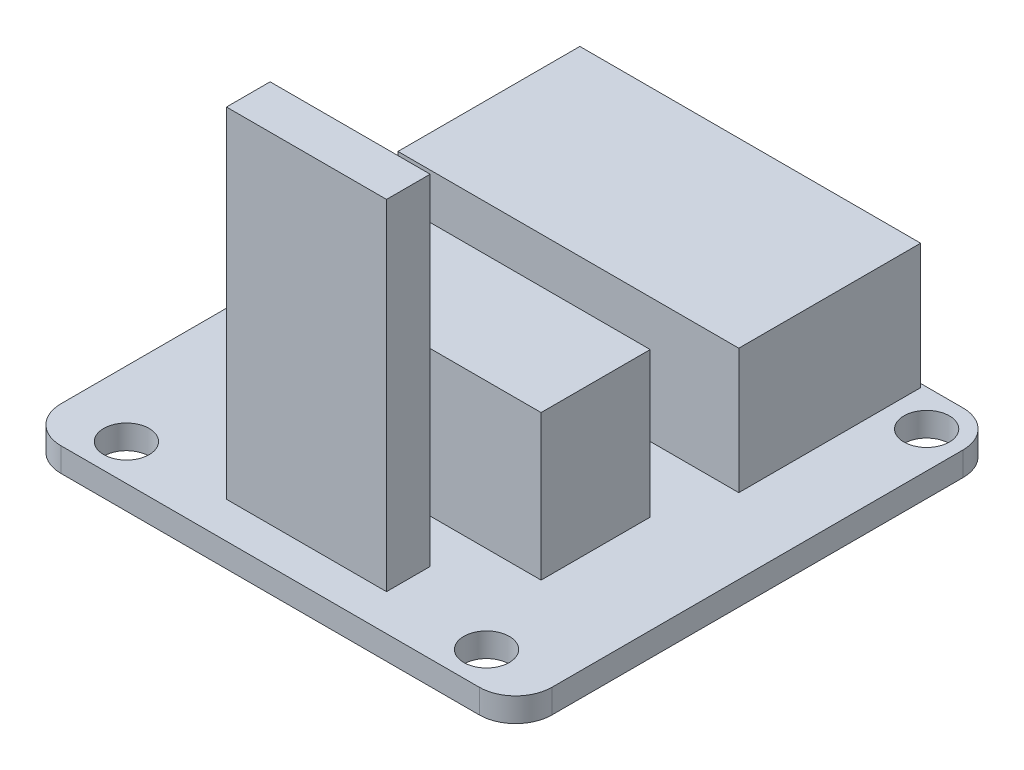
ISO-10303-21;
HEADER;
FILE_DESCRIPTION(('STEP AP214'),'2;1');
FILE_NAME('part.step','',(''),(''),'','','');
FILE_SCHEMA(('AUTOMOTIVE_DESIGN { 1 0 10303 214 1 1 1 1 }'));
ENDSEC;
DATA;
#1=APPLICATION_CONTEXT('core data for automotive mechanical design processes');
#2=APPLICATION_PROTOCOL_DEFINITION('international standard','automotive_design',2000,#1);
#3=PRODUCT_CONTEXT('',#1,'mechanical');
#4=PRODUCT('Part','Part','',(#3));
#5=PRODUCT_RELATED_PRODUCT_CATEGORY('part','',(#4));
#6=PRODUCT_DEFINITION_FORMATION('','',#4);
#7=PRODUCT_DEFINITION_CONTEXT('part definition',#1,'design');
#8=PRODUCT_DEFINITION('design','',#6,#7);
#9=PRODUCT_DEFINITION_SHAPE('','',#8);
#10=(LENGTH_UNIT() NAMED_UNIT(*) SI_UNIT(.MILLI.,.METRE.));
#11=(NAMED_UNIT(*) PLANE_ANGLE_UNIT() SI_UNIT($,.RADIAN.));
#12=(NAMED_UNIT(*) SI_UNIT($,.STERADIAN.) SOLID_ANGLE_UNIT());
#13=UNCERTAINTY_MEASURE_WITH_UNIT(LENGTH_MEASURE(1.E-05),#10,'distance_accuracy_value','');
#14=(GEOMETRIC_REPRESENTATION_CONTEXT(3) GLOBAL_UNCERTAINTY_ASSIGNED_CONTEXT((#13)) GLOBAL_UNIT_ASSIGNED_CONTEXT((#10,
#11,#12)) REPRESENTATION_CONTEXT('',''));
#15=CARTESIAN_POINT('',(0.,0.,0.));
#16=DIRECTION('',(0.,0.,1.));
#17=DIRECTION('',(1.,0.,0.));
#18=AXIS2_PLACEMENT_3D('',#15,#16,#17);
#19=CARTESIAN_POINT('',(0.,1.6764,0.));
#20=DIRECTION('',(0.,1.,0.));
#21=DIRECTION('',(0.,0.,1.));
#22=AXIS2_PLACEMENT_3D('',#19,#20,#21);
#23=PLANE('',#22);
#24=DIRECTION('',(0.,0.,1.));
#25=VECTOR('',#24,1.);
#26=CARTESIAN_POINT('',(-5.588,1.6764,0.));
#27=LINE('',#26,#25);
#28=CARTESIAN_POINT('',(-5.588,1.6764,11.303));
#29=VERTEX_POINT('',#28);
#30=CARTESIAN_POINT('',(-5.588,1.6764,14.351));
#31=VERTEX_POINT('',#30);
#32=EDGE_CURVE('E203',#29,#31,#27,.T.);
#33=ORIENTED_EDGE('',*,*,#32,.F.);
#34=DIRECTION('',(-1.,0.,0.));
#35=VECTOR('',#34,1.);
#36=CARTESIAN_POINT('',(0.,1.6764,11.303));
#37=LINE('',#36,#35);
#38=CARTESIAN_POINT('',(5.588,1.6764,11.303));
#39=VERTEX_POINT('',#38);
#40=EDGE_CURVE('E173',#39,#29,#37,.T.);
#41=ORIENTED_EDGE('',*,*,#40,.F.);
#42=DIRECTION('',(0.,0.,1.));
#43=VECTOR('',#42,1.);
#44=CARTESIAN_POINT('',(5.588,1.6764,0.));
#45=LINE('',#44,#43);
#46=CARTESIAN_POINT('',(5.588,1.6764,14.351));
#47=VERTEX_POINT('',#46);
#48=EDGE_CURVE('E53',#39,#47,#45,.T.);
#49=ORIENTED_EDGE('',*,*,#48,.T.);
#50=DIRECTION('',(-1.,0.,0.));
#51=VECTOR('',#50,1.);
#52=CARTESIAN_POINT('',(0.,1.6764,14.351));
#53=LINE('',#52,#51);
#54=EDGE_CURVE('E48',#47,#31,#53,.T.);
#55=ORIENTED_EDGE('',*,*,#54,.T.);
#56=EDGE_LOOP('',(#33,#41,#49,#55));
#57=FACE_BOUND('',#56,.T.);
#58=DIRECTION('',(-1.,0.,0.));
#59=VECTOR('',#58,1.);
#60=CARTESIAN_POINT('',(0.,1.6764,-16.637));
#61=LINE('',#60,#59);
#62=CARTESIAN_POINT('',(11.8999,1.6764,-16.637));
#63=VERTEX_POINT('',#62);
#64=CARTESIAN_POINT('',(-11.8999,1.6764,-16.637));
#65=VERTEX_POINT('',#64);
#66=EDGE_CURVE('E267',#63,#65,#61,.T.);
#67=ORIENTED_EDGE('',*,*,#66,.F.);
#68=DIRECTION('',(0.,0.,-1.));
#69=VECTOR('',#68,1.);
#70=CARTESIAN_POINT('',(11.8999,1.6764,0.));
#71=LINE('',#70,#69);
#72=CARTESIAN_POINT('',(11.8999,1.6764,-3.937));
#73=VERTEX_POINT('',#72);
#74=EDGE_CURVE('E252',#73,#63,#71,.T.);
#75=ORIENTED_EDGE('',*,*,#74,.F.);
#76=DIRECTION('',(-1.,0.,0.));
#77=VECTOR('',#76,1.);
#78=CARTESIAN_POINT('',(0.,1.6764,-3.937));
#79=LINE('',#78,#77);
#80=CARTESIAN_POINT('',(-11.8999,1.6764,-3.937));
#81=VERTEX_POINT('',#80);
#82=EDGE_CURVE('E263',#73,#81,#79,.T.);
#83=ORIENTED_EDGE('',*,*,#82,.T.);
#84=DIRECTION('',(0.,0.,-1.));
#85=VECTOR('',#84,1.);
#86=CARTESIAN_POINT('',(-11.8999,1.6764,0.));
#87=LINE('',#86,#85);
#88=EDGE_CURVE('E265',#81,#65,#87,.T.);
#89=ORIENTED_EDGE('',*,*,#88,.T.);
#90=EDGE_LOOP('',(#67,#75,#83,#89));
#91=FACE_BOUND('',#90,.T.);
#92=CARTESIAN_POINT('',(-14.605,1.6764,-14.351));
#93=DIRECTION('',(0.,1.,0.));
#94=DIRECTION('',(0.,0.,1.));
#95=AXIS2_PLACEMENT_3D('',#92,#93,#94);
#96=CIRCLE('',#95,2.54);
#97=CARTESIAN_POINT('',(-17.145,1.6764,-14.351));
#98=VERTEX_POINT('',#97);
#99=CARTESIAN_POINT('',(-14.605,1.6764,-16.891));
#100=VERTEX_POINT('',#99);
#101=EDGE_CURVE('E271',#98,#100,#96,.F.);
#102=ORIENTED_EDGE('',*,*,#101,.F.);
#103=DIRECTION('',(0.,0.,-1.));
#104=VECTOR('',#103,1.);
#105=CARTESIAN_POINT('',(-17.145,1.6764,0.));
#106=LINE('',#105,#104);
#107=CARTESIAN_POINT('',(-17.145,1.6764,14.351));
#108=VERTEX_POINT('',#107);
#109=EDGE_CURVE('E274',#108,#98,#106,.T.);
#110=ORIENTED_EDGE('',*,*,#109,.F.);
#111=CARTESIAN_POINT('',(-14.605,1.6764,14.351));
#112=DIRECTION('',(0.,1.,0.));
#113=DIRECTION('',(0.,0.,1.));
#114=AXIS2_PLACEMENT_3D('',#111,#112,#113);
#115=CIRCLE('',#114,2.54);
#116=CARTESIAN_POINT('',(-14.605,1.6764,16.891));
#117=VERTEX_POINT('',#116);
#118=EDGE_CURVE('E278',#117,#108,#115,.F.);
#119=ORIENTED_EDGE('',*,*,#118,.F.);
#120=DIRECTION('',(1.,0.,0.));
#121=VECTOR('',#120,1.);
#122=CARTESIAN_POINT('',(0.,1.6764,16.891));
#123=LINE('',#122,#121);
#124=CARTESIAN_POINT('',(14.605,1.6764,16.891));
#125=VERTEX_POINT('',#124);
#126=EDGE_CURVE('E281',#117,#125,#123,.T.);
#127=ORIENTED_EDGE('',*,*,#126,.T.);
#128=CARTESIAN_POINT('',(14.605,1.6764,14.351));
#129=DIRECTION('',(0.,1.,0.));
#130=DIRECTION('',(0.,0.,1.));
#131=AXIS2_PLACEMENT_3D('',#128,#129,#130);
#132=CIRCLE('',#131,2.54);
#133=CARTESIAN_POINT('',(17.145,1.6764,14.351));
#134=VERTEX_POINT('',#133);
#135=EDGE_CURVE('E283',#125,#134,#132,.T.);
#136=ORIENTED_EDGE('',*,*,#135,.T.);
#137=DIRECTION('',(0.,0.,-1.));
#138=VECTOR('',#137,1.);
#139=CARTESIAN_POINT('',(17.145,1.6764,0.));
#140=LINE('',#139,#138);
#141=CARTESIAN_POINT('',(17.145,1.6764,-14.351));
#142=VERTEX_POINT('',#141);
#143=EDGE_CURVE('E285',#134,#142,#140,.T.);
#144=ORIENTED_EDGE('',*,*,#143,.T.);
#145=CARTESIAN_POINT('',(14.605,1.6764,-14.351));
#146=DIRECTION('',(0.,1.,0.));
#147=DIRECTION('',(0.,0.,1.));
#148=AXIS2_PLACEMENT_3D('',#145,#146,#147);
#149=CIRCLE('',#148,2.54);
#150=CARTESIAN_POINT('',(14.605,1.6764,-16.891));
#151=VERTEX_POINT('',#150);
#152=EDGE_CURVE('E287',#151,#142,#149,.F.);
#153=ORIENTED_EDGE('',*,*,#152,.F.);
#154=DIRECTION('',(1.,0.,0.));
#155=VECTOR('',#154,1.);
#156=CARTESIAN_POINT('',(0.,1.6764,-16.891));
#157=LINE('',#156,#155);
#158=EDGE_CURVE('E290',#100,#151,#157,.T.);
#159=ORIENTED_EDGE('',*,*,#158,.F.);
#160=EDGE_LOOP('',(#102,#110,#119,#127,#136,#144,#153,#159));
#161=FACE_BOUND('',#160,.T.);
#162=CARTESIAN_POINT('',(14.605,1.6764,-14.351));
#163=DIRECTION('',(0.,1.,0.));
#164=DIRECTION('',(0.,0.,1.));
#165=AXIS2_PLACEMENT_3D('',#162,#163,#164);
#166=CIRCLE('',#165,1.5875);
#167=CARTESIAN_POINT('',(14.605,1.6764,-12.7635));
#168=VERTEX_POINT('',#167);
#169=EDGE_CURVE('E293',#168,#168,#166,.T.);
#170=ORIENTED_EDGE('',*,*,#169,.F.);
#171=EDGE_LOOP('',(#170));
#172=FACE_BOUND('',#171,.T.);
#173=CARTESIAN_POINT('',(12.573,1.6764,14.351));
#174=DIRECTION('',(0.,1.,0.));
#175=DIRECTION('',(0.,0.,1.));
#176=AXIS2_PLACEMENT_3D('',#173,#174,#175);
#177=CIRCLE('',#176,1.5875);
#178=CARTESIAN_POINT('',(12.573,1.6764,15.9385));
#179=VERTEX_POINT('',#178);
#180=EDGE_CURVE('E296',#179,#179,#177,.T.);
#181=ORIENTED_EDGE('',*,*,#180,.F.);
#182=EDGE_LOOP('',(#181));
#183=FACE_BOUND('',#182,.T.);
#184=CARTESIAN_POINT('',(-12.573,1.6764,14.351));
#185=DIRECTION('',(0.,1.,0.));
#186=DIRECTION('',(0.,0.,1.));
#187=AXIS2_PLACEMENT_3D('',#184,#185,#186);
#188=CIRCLE('',#187,1.5875);
#189=CARTESIAN_POINT('',(-12.573,1.6764,15.9385));
#190=VERTEX_POINT('',#189);
#191=EDGE_CURVE('E299',#190,#190,#188,.T.);
#192=ORIENTED_EDGE('',*,*,#191,.F.);
#193=EDGE_LOOP('',(#192));
#194=FACE_BOUND('',#193,.T.);
#195=CARTESIAN_POINT('',(-14.605,1.6764,-14.351));
#196=DIRECTION('',(0.,1.,0.));
#197=DIRECTION('',(0.,0.,1.));
#198=AXIS2_PLACEMENT_3D('',#195,#196,#197);
#199=CIRCLE('',#198,1.5875);
#200=CARTESIAN_POINT('',(-14.605,1.6764,-12.7635));
#201=VERTEX_POINT('',#200);
#202=EDGE_CURVE('E302',#201,#201,#199,.T.);
#203=ORIENTED_EDGE('',*,*,#202,.F.);
#204=EDGE_LOOP('',(#203));
#205=FACE_BOUND('',#204,.T.);
#206=DIRECTION('',(0.,0.,1.));
#207=VECTOR('',#206,1.);
#208=CARTESIAN_POINT('',(10.287,1.6764,0.));
#209=LINE('',#208,#207);
#210=CARTESIAN_POINT('',(10.287,1.6764,0.634999999999998));
#211=VERTEX_POINT('',#210);
#212=CARTESIAN_POINT('',(10.287,1.6764,8.255));
#213=VERTEX_POINT('',#212);
#214=EDGE_CURVE('E234',#211,#213,#209,.T.);
#215=ORIENTED_EDGE('',*,*,#214,.T.);
#216=DIRECTION('',(-1.,0.,0.));
#217=VECTOR('',#216,1.);
#218=CARTESIAN_POINT('',(0.,1.6764,8.255));
#219=LINE('',#218,#217);
#220=CARTESIAN_POINT('',(-10.287,1.6764,8.255));
#221=VERTEX_POINT('',#220);
#222=EDGE_CURVE('E236',#213,#221,#219,.T.);
#223=ORIENTED_EDGE('',*,*,#222,.T.);
#224=DIRECTION('',(0.,0.,1.));
#225=VECTOR('',#224,1.);
#226=CARTESIAN_POINT('',(-10.287,1.6764,0.));
#227=LINE('',#226,#225);
#228=CARTESIAN_POINT('',(-10.287,1.6764,0.634999999999998));
#229=VERTEX_POINT('',#228);
#230=EDGE_CURVE('E228',#229,#221,#227,.T.);
#231=ORIENTED_EDGE('',*,*,#230,.F.);
#232=DIRECTION('',(-1.,0.,0.));
#233=VECTOR('',#232,1.);
#234=CARTESIAN_POINT('',(0.,1.6764,0.634999999999998));
#235=LINE('',#234,#233);
#236=EDGE_CURVE('E231',#211,#229,#235,.T.);
#237=ORIENTED_EDGE('',*,*,#236,.F.);
#238=EDGE_LOOP('',(#215,#223,#231,#237));
#239=FACE_BOUND('',#238,.T.);
#240=ADVANCED_FACE('F33',(#57,#91,#161,#172,#183,#194,#205,#239),#23,.T.);
#241=CARTESIAN_POINT('',(-14.605,1.6764,-14.351));
#242=DIRECTION('',(0.,-1.,0.));
#243=DIRECTION('',(0.,0.,-1.));
#244=AXIS2_PLACEMENT_3D('',#241,#242,#243);
#245=CYLINDRICAL_SURFACE('',#244,2.54);
#246=CARTESIAN_POINT('',(-14.605,0.,-14.351));
#247=DIRECTION('',(0.,1.,0.));
#248=DIRECTION('',(0.,0.,1.));
#249=AXIS2_PLACEMENT_3D('',#246,#247,#248);
#250=CIRCLE('',#249,2.54);
#251=CARTESIAN_POINT('',(-17.145,0.,-14.351));
#252=VERTEX_POINT('',#251);
#253=CARTESIAN_POINT('',(-14.605,0.,-16.891));
#254=VERTEX_POINT('',#253);
#255=EDGE_CURVE('E270',#252,#254,#250,.F.);
#256=ORIENTED_EDGE('',*,*,#255,.F.);
#257=DIRECTION('',(0.,-1.,0.));
#258=VECTOR('',#257,1.);
#259=CARTESIAN_POINT('',(-17.145,1.6764,-14.351));
#260=LINE('',#259,#258);
#261=EDGE_CURVE('E11',#98,#252,#260,.T.);
#262=ORIENTED_EDGE('',*,*,#261,.F.);
#263=ORIENTED_EDGE('',*,*,#101,.T.);
#264=DIRECTION('',(0.,-1.,0.));
#265=VECTOR('',#264,1.);
#266=CARTESIAN_POINT('',(-14.605,1.6764,-16.891));
#267=LINE('',#266,#265);
#268=EDGE_CURVE('E305',#100,#254,#267,.T.);
#269=ORIENTED_EDGE('',*,*,#268,.T.);
#270=EDGE_LOOP('',(#256,#262,#263,#269));
#271=FACE_BOUND('',#270,.T.);
#272=ADVANCED_FACE('F35',(#271),#245,.T.);
#273=CARTESIAN_POINT('',(-17.145,1.6764,0.));
#274=DIRECTION('',(-1.,0.,0.));
#275=DIRECTION('',(0.,0.,1.));
#276=AXIS2_PLACEMENT_3D('',#273,#274,#275);
#277=PLANE('',#276);
#278=DIRECTION('',(0.,0.,-1.));
#279=VECTOR('',#278,1.);
#280=CARTESIAN_POINT('',(-17.145,0.,0.));
#281=LINE('',#280,#279);
#282=CARTESIAN_POINT('',(-17.145,0.,14.351));
#283=VERTEX_POINT('',#282);
#284=EDGE_CURVE('E308',#283,#252,#281,.T.);
#285=ORIENTED_EDGE('',*,*,#284,.F.);
#286=DIRECTION('',(0.,-1.,0.));
#287=VECTOR('',#286,1.);
#288=CARTESIAN_POINT('',(-17.145,1.6764,14.351));
#289=LINE('',#288,#287);
#290=EDGE_CURVE('E41',#108,#283,#289,.T.);
#291=ORIENTED_EDGE('',*,*,#290,.F.);
#292=ORIENTED_EDGE('',*,*,#109,.T.);
#293=ORIENTED_EDGE('',*,*,#261,.T.);
#294=EDGE_LOOP('',(#285,#291,#292,#293));
#295=FACE_BOUND('',#294,.T.);
#296=ADVANCED_FACE('F357',(#295),#277,.T.);
#297=CARTESIAN_POINT('',(-14.605,1.6764,14.351));
#298=DIRECTION('',(0.,-1.,0.));
#299=DIRECTION('',(0.,0.,-1.));
#300=AXIS2_PLACEMENT_3D('',#297,#298,#299);
#301=CYLINDRICAL_SURFACE('',#300,2.54);
#302=CARTESIAN_POINT('',(-14.605,0.,14.351));
#303=DIRECTION('',(0.,1.,0.));
#304=DIRECTION('',(0.,0.,1.));
#305=AXIS2_PLACEMENT_3D('',#302,#303,#304);
#306=CIRCLE('',#305,2.54);
#307=CARTESIAN_POINT('',(-14.605,0.,16.891));
#308=VERTEX_POINT('',#307);
#309=EDGE_CURVE('E311',#308,#283,#306,.F.);
#310=ORIENTED_EDGE('',*,*,#309,.F.);
#311=DIRECTION('',(0.,-1.,0.));
#312=VECTOR('',#311,1.);
#313=CARTESIAN_POINT('',(-14.605,1.6764,16.891));
#314=LINE('',#313,#312);
#315=EDGE_CURVE('E349',#117,#308,#314,.T.);
#316=ORIENTED_EDGE('',*,*,#315,.F.);
#317=ORIENTED_EDGE('',*,*,#118,.T.);
#318=ORIENTED_EDGE('',*,*,#290,.T.);
#319=EDGE_LOOP('',(#310,#316,#317,#318));
#320=FACE_BOUND('',#319,.T.);
#321=ADVANCED_FACE('F353',(#320),#301,.T.);
#322=CARTESIAN_POINT('',(0.,1.6764,16.891));
#323=DIRECTION('',(0.,0.,-1.));
#324=DIRECTION('',(-1.,0.,0.));
#325=AXIS2_PLACEMENT_3D('',#322,#323,#324);
#326=PLANE('',#325);
#327=DIRECTION('',(1.,0.,0.));
#328=VECTOR('',#327,1.);
#329=CARTESIAN_POINT('',(0.,0.,16.891));
#330=LINE('',#329,#328);
#331=CARTESIAN_POINT('',(14.605,0.,16.891));
#332=VERTEX_POINT('',#331);
#333=EDGE_CURVE('E314',#308,#332,#330,.T.);
#334=ORIENTED_EDGE('',*,*,#333,.T.);
#335=DIRECTION('',(0.,-1.,0.));
#336=VECTOR('',#335,1.);
#337=CARTESIAN_POINT('',(14.605,1.6764,16.891));
#338=LINE('',#337,#336);
#339=EDGE_CURVE('E346',#125,#332,#338,.T.);
#340=ORIENTED_EDGE('',*,*,#339,.F.);
#341=ORIENTED_EDGE('',*,*,#126,.F.);
#342=ORIENTED_EDGE('',*,*,#315,.T.);
#343=EDGE_LOOP('',(#334,#340,#341,#342));
#344=FACE_BOUND('',#343,.T.);
#345=ADVANCED_FACE('F366',(#344),#326,.F.);
#346=CARTESIAN_POINT('',(14.605,1.6764,14.351));
#347=DIRECTION('',(0.,-1.,0.));
#348=DIRECTION('',(0.,0.,-1.));
#349=AXIS2_PLACEMENT_3D('',#346,#347,#348);
#350=CYLINDRICAL_SURFACE('',#349,2.54);
#351=CARTESIAN_POINT('',(14.605,0.,14.351));
#352=DIRECTION('',(0.,1.,0.));
#353=DIRECTION('',(0.,0.,1.));
#354=AXIS2_PLACEMENT_3D('',#351,#352,#353);
#355=CIRCLE('',#354,2.54);
#356=CARTESIAN_POINT('',(17.145,0.,14.351));
#357=VERTEX_POINT('',#356);
#358=EDGE_CURVE('E316',#332,#357,#355,.T.);
#359=ORIENTED_EDGE('',*,*,#358,.T.);
#360=DIRECTION('',(0.,-1.,0.));
#361=VECTOR('',#360,1.);
#362=CARTESIAN_POINT('',(17.145,1.6764,14.351));
#363=LINE('',#362,#361);
#364=EDGE_CURVE('E343',#134,#357,#363,.T.);
#365=ORIENTED_EDGE('',*,*,#364,.F.);
#366=ORIENTED_EDGE('',*,*,#135,.F.);
#367=ORIENTED_EDGE('',*,*,#339,.T.);
#368=EDGE_LOOP('',(#359,#365,#366,#367));
#369=FACE_BOUND('',#368,.T.);
#370=ADVANCED_FACE('F370',(#369),#350,.T.);
#371=CARTESIAN_POINT('',(17.145,1.6764,0.));
#372=DIRECTION('',(-1.,0.,0.));
#373=DIRECTION('',(0.,0.,1.));
#374=AXIS2_PLACEMENT_3D('',#371,#372,#373);
#375=PLANE('',#374);
#376=DIRECTION('',(0.,0.,-1.));
#377=VECTOR('',#376,1.);
#378=CARTESIAN_POINT('',(17.145,0.,0.));
#379=LINE('',#378,#377);
#380=CARTESIAN_POINT('',(17.145,0.,-14.351));
#381=VERTEX_POINT('',#380);
#382=EDGE_CURVE('E318',#357,#381,#379,.T.);
#383=ORIENTED_EDGE('',*,*,#382,.T.);
#384=DIRECTION('',(0.,-1.,0.));
#385=VECTOR('',#384,1.);
#386=CARTESIAN_POINT('',(17.145,1.6764,-14.351));
#387=LINE('',#386,#385);
#388=EDGE_CURVE('E341',#142,#381,#387,.T.);
#389=ORIENTED_EDGE('',*,*,#388,.F.);
#390=ORIENTED_EDGE('',*,*,#143,.F.);
#391=ORIENTED_EDGE('',*,*,#364,.T.);
#392=EDGE_LOOP('',(#383,#389,#390,#391));
#393=FACE_BOUND('',#392,.T.);
#394=ADVANCED_FACE('F387',(#393),#375,.F.);
#395=CARTESIAN_POINT('',(14.605,1.6764,-14.351));
#396=DIRECTION('',(0.,-1.,0.));
#397=DIRECTION('',(0.,0.,-1.));
#398=AXIS2_PLACEMENT_3D('',#395,#396,#397);
#399=CYLINDRICAL_SURFACE('',#398,2.54);
#400=CARTESIAN_POINT('',(14.605,0.,-14.351));
#401=DIRECTION('',(0.,1.,0.));
#402=DIRECTION('',(0.,0.,1.));
#403=AXIS2_PLACEMENT_3D('',#400,#401,#402);
#404=CIRCLE('',#403,2.54);
#405=CARTESIAN_POINT('',(14.605,0.,-16.891));
#406=VERTEX_POINT('',#405);
#407=EDGE_CURVE('E321',#406,#381,#404,.F.);
#408=ORIENTED_EDGE('',*,*,#407,.F.);
#409=DIRECTION('',(0.,-1.,0.));
#410=VECTOR('',#409,1.);
#411=CARTESIAN_POINT('',(14.605,1.6764,-16.891));
#412=LINE('',#411,#410);
#413=EDGE_CURVE('E339',#151,#406,#412,.T.);
#414=ORIENTED_EDGE('',*,*,#413,.F.);
#415=ORIENTED_EDGE('',*,*,#152,.T.);
#416=ORIENTED_EDGE('',*,*,#388,.T.);
#417=EDGE_LOOP('',(#408,#414,#415,#416));
#418=FACE_BOUND('',#417,.T.);
#419=ADVANCED_FACE('F385',(#418),#399,.T.);
#420=CARTESIAN_POINT('',(-12.573,1.6764,14.351));
#421=DIRECTION('',(0.,-1.,0.));
#422=DIRECTION('',(0.,0.,-1.));
#423=AXIS2_PLACEMENT_3D('',#420,#421,#422);
#424=CYLINDRICAL_SURFACE('',#423,1.5875);
#425=ORIENTED_EDGE('',*,*,#191,.T.);
#426=EDGE_LOOP('',(#425));
#427=FACE_BOUND('',#426,.T.);
#428=CARTESIAN_POINT('',(-12.573,0.,14.351));
#429=DIRECTION('',(0.,1.,0.));
#430=DIRECTION('',(0.,0.,1.));
#431=AXIS2_PLACEMENT_3D('',#428,#429,#430);
#432=CIRCLE('',#431,1.5875);
#433=CARTESIAN_POINT('',(-12.573,0.,15.9385));
#434=VERTEX_POINT('',#433);
#435=EDGE_CURVE('E333',#434,#434,#432,.T.);
#436=ORIENTED_EDGE('',*,*,#435,.F.);
#437=EDGE_LOOP('',(#436));
#438=FACE_BOUND('',#437,.T.);
#439=ADVANCED_FACE('F394',(#427,#438),#424,.F.);
#440=CARTESIAN_POINT('',(12.573,1.6764,14.351));
#441=DIRECTION('',(0.,-1.,0.));
#442=DIRECTION('',(0.,0.,-1.));
#443=AXIS2_PLACEMENT_3D('',#440,#441,#442);
#444=CYLINDRICAL_SURFACE('',#443,1.5875);
#445=ORIENTED_EDGE('',*,*,#180,.T.);
#446=EDGE_LOOP('',(#445));
#447=FACE_BOUND('',#446,.T.);
#448=CARTESIAN_POINT('',(12.573,0.,14.351));
#449=DIRECTION('',(0.,1.,0.));
#450=DIRECTION('',(0.,0.,1.));
#451=AXIS2_PLACEMENT_3D('',#448,#449,#450);
#452=CIRCLE('',#451,1.5875);
#453=CARTESIAN_POINT('',(12.573,0.,15.9385));
#454=VERTEX_POINT('',#453);
#455=EDGE_CURVE('E330',#454,#454,#452,.T.);
#456=ORIENTED_EDGE('',*,*,#455,.F.);
#457=EDGE_LOOP('',(#456));
#458=FACE_BOUND('',#457,.T.);
#459=ADVANCED_FACE('F416',(#447,#458),#444,.F.);
#460=CARTESIAN_POINT('',(14.605,1.6764,-14.351));
#461=DIRECTION('',(0.,-1.,0.));
#462=DIRECTION('',(0.,0.,-1.));
#463=AXIS2_PLACEMENT_3D('',#460,#461,#462);
#464=CYLINDRICAL_SURFACE('',#463,1.5875);
#465=ORIENTED_EDGE('',*,*,#169,.T.);
#466=EDGE_LOOP('',(#465));
#467=FACE_BOUND('',#466,.T.);
#468=CARTESIAN_POINT('',(14.605,0.,-14.351));
#469=DIRECTION('',(0.,1.,0.));
#470=DIRECTION('',(0.,0.,1.));
#471=AXIS2_PLACEMENT_3D('',#468,#469,#470);
#472=CIRCLE('',#471,1.5875);
#473=CARTESIAN_POINT('',(14.605,0.,-12.7635));
#474=VERTEX_POINT('',#473);
#475=EDGE_CURVE('E327',#474,#474,#472,.T.);
#476=ORIENTED_EDGE('',*,*,#475,.F.);
#477=EDGE_LOOP('',(#476));
#478=FACE_BOUND('',#477,.T.);
#479=ADVANCED_FACE('F420',(#467,#478),#464,.F.);
#480=CARTESIAN_POINT('',(0.,1.6764,-16.891));
#481=DIRECTION('',(0.,0.,-1.));
#482=DIRECTION('',(-1.,0.,0.));
#483=AXIS2_PLACEMENT_3D('',#480,#481,#482);
#484=PLANE('',#483);
#485=DIRECTION('',(1.,0.,0.));
#486=VECTOR('',#485,1.);
#487=CARTESIAN_POINT('',(0.,0.,-16.891));
#488=LINE('',#487,#486);
#489=EDGE_CURVE('E324',#254,#406,#488,.T.);
#490=ORIENTED_EDGE('',*,*,#489,.F.);
#491=ORIENTED_EDGE('',*,*,#268,.F.);
#492=ORIENTED_EDGE('',*,*,#158,.T.);
#493=ORIENTED_EDGE('',*,*,#413,.T.);
#494=EDGE_LOOP('',(#490,#491,#492,#493));
#495=FACE_BOUND('',#494,.T.);
#496=ADVANCED_FACE('F382',(#495),#484,.T.);
#497=CARTESIAN_POINT('',(-14.605,1.6764,-14.351));
#498=DIRECTION('',(0.,-1.,0.));
#499=DIRECTION('',(0.,0.,-1.));
#500=AXIS2_PLACEMENT_3D('',#497,#498,#499);
#501=CYLINDRICAL_SURFACE('',#500,1.5875);
#502=ORIENTED_EDGE('',*,*,#202,.T.);
#503=EDGE_LOOP('',(#502));
#504=FACE_BOUND('',#503,.T.);
#505=CARTESIAN_POINT('',(-14.605,0.,-14.351));
#506=DIRECTION('',(0.,1.,0.));
#507=DIRECTION('',(0.,0.,1.));
#508=AXIS2_PLACEMENT_3D('',#505,#506,#507);
#509=CIRCLE('',#508,1.5875);
#510=CARTESIAN_POINT('',(-14.605,0.,-12.7635));
#511=VERTEX_POINT('',#510);
#512=EDGE_CURVE('E275',#511,#511,#509,.T.);
#513=ORIENTED_EDGE('',*,*,#512,.F.);
#514=EDGE_LOOP('',(#513));
#515=FACE_BOUND('',#514,.T.);
#516=ADVANCED_FACE('F409',(#504,#515),#501,.F.);
#517=CARTESIAN_POINT('',(0.,0.,0.));
#518=DIRECTION('',(0.,1.,0.));
#519=DIRECTION('',(0.,0.,1.));
#520=AXIS2_PLACEMENT_3D('',#517,#518,#519);
#521=PLANE('',#520);
#522=ORIENTED_EDGE('',*,*,#512,.T.);
#523=EDGE_LOOP('',(#522));
#524=FACE_BOUND('',#523,.T.);
#525=ORIENTED_EDGE('',*,*,#435,.T.);
#526=EDGE_LOOP('',(#525));
#527=FACE_BOUND('',#526,.T.);
#528=ORIENTED_EDGE('',*,*,#455,.T.);
#529=EDGE_LOOP('',(#528));
#530=FACE_BOUND('',#529,.T.);
#531=ORIENTED_EDGE('',*,*,#475,.T.);
#532=EDGE_LOOP('',(#531));
#533=FACE_BOUND('',#532,.T.);
#534=ORIENTED_EDGE('',*,*,#255,.T.);
#535=ORIENTED_EDGE('',*,*,#489,.T.);
#536=ORIENTED_EDGE('',*,*,#407,.T.);
#537=ORIENTED_EDGE('',*,*,#382,.F.);
#538=ORIENTED_EDGE('',*,*,#358,.F.);
#539=ORIENTED_EDGE('',*,*,#333,.F.);
#540=ORIENTED_EDGE('',*,*,#309,.T.);
#541=ORIENTED_EDGE('',*,*,#284,.T.);
#542=EDGE_LOOP('',(#534,#535,#536,#537,#538,#539,#540,#541));
#543=FACE_BOUND('',#542,.T.);
#544=ADVANCED_FACE('F361',(#524,#527,#530,#533,#543),#521,.F.);
#545=CARTESIAN_POINT('',(-11.8999,10.414,-16.637));
#546=DIRECTION('',(0.,0.,-1.));
#547=DIRECTION('',(-1.,0.,0.));
#548=AXIS2_PLACEMENT_3D('',#545,#546,#547);
#549=PLANE('',#548);
#550=DIRECTION('',(0.,-1.,0.));
#551=VECTOR('',#550,1.);
#552=CARTESIAN_POINT('',(11.8999,10.414,-16.637));
#553=LINE('',#552,#551);
#554=CARTESIAN_POINT('',(11.8999,10.414,-16.637));
#555=VERTEX_POINT('',#554);
#556=EDGE_CURVE('E248',#555,#63,#553,.T.);
#557=ORIENTED_EDGE('',*,*,#556,.T.);
#558=ORIENTED_EDGE('',*,*,#66,.T.);
#559=DIRECTION('',(0.,-1.,0.));
#560=VECTOR('',#559,1.);
#561=CARTESIAN_POINT('',(-11.8999,10.414,-16.637));
#562=LINE('',#561,#560);
#563=CARTESIAN_POINT('',(-11.8999,10.414,-16.637));
#564=VERTEX_POINT('',#563);
#565=EDGE_CURVE('E249',#564,#65,#562,.T.);
#566=ORIENTED_EDGE('',*,*,#565,.F.);
#567=DIRECTION('',(1.,0.,0.));
#568=VECTOR('',#567,1.);
#569=CARTESIAN_POINT('',(-11.8999,10.414,-16.637));
#570=LINE('',#569,#568);
#571=EDGE_CURVE('E238',#564,#555,#570,.T.);
#572=ORIENTED_EDGE('',*,*,#571,.T.);
#573=EDGE_LOOP('',(#557,#558,#566,#572));
#574=FACE_BOUND('',#573,.T.);
#575=ADVANCED_FACE('F405',(#574),#549,.T.);
#576=CARTESIAN_POINT('',(-11.8999,10.414,-16.637));
#577=DIRECTION('',(1.,0.,0.));
#578=DIRECTION('',(0.,0.,-1.));
#579=AXIS2_PLACEMENT_3D('',#576,#577,#578);
#580=PLANE('',#579);
#581=ORIENTED_EDGE('',*,*,#88,.F.);
#582=DIRECTION('',(0.,-1.,0.));
#583=VECTOR('',#582,1.);
#584=CARTESIAN_POINT('',(-11.8999,10.414,-3.937));
#585=LINE('',#584,#583);
#586=CARTESIAN_POINT('',(-11.8999,10.414,-3.937));
#587=VERTEX_POINT('',#586);
#588=EDGE_CURVE('E253',#587,#81,#585,.T.);
#589=ORIENTED_EDGE('',*,*,#588,.F.);
#590=DIRECTION('',(0.,0.,1.));
#591=VECTOR('',#590,1.);
#592=CARTESIAN_POINT('',(-11.8999,10.414,-16.637));
#593=LINE('',#592,#591);
#594=EDGE_CURVE('E246',#564,#587,#593,.T.);
#595=ORIENTED_EDGE('',*,*,#594,.F.);
#596=ORIENTED_EDGE('',*,*,#565,.T.);
#597=EDGE_LOOP('',(#581,#589,#595,#596));
#598=FACE_BOUND('',#597,.T.);
#599=ADVANCED_FACE('F445',(#598),#580,.F.);
#600=CARTESIAN_POINT('',(-11.8999,10.414,-3.937));
#601=DIRECTION('',(0.,0.,-1.));
#602=DIRECTION('',(-1.,0.,0.));
#603=AXIS2_PLACEMENT_3D('',#600,#601,#602);
#604=PLANE('',#603);
#605=ORIENTED_EDGE('',*,*,#82,.F.);
#606=DIRECTION('',(0.,-1.,0.));
#607=VECTOR('',#606,1.);
#608=CARTESIAN_POINT('',(11.8999,10.414,-3.937));
#609=LINE('',#608,#607);
#610=CARTESIAN_POINT('',(11.8999,10.414,-3.937));
#611=VERTEX_POINT('',#610);
#612=EDGE_CURVE('E256',#611,#73,#609,.T.);
#613=ORIENTED_EDGE('',*,*,#612,.F.);
#614=DIRECTION('',(1.,0.,0.));
#615=VECTOR('',#614,1.);
#616=CARTESIAN_POINT('',(-11.8999,10.414,-3.937));
#617=LINE('',#616,#615);
#618=EDGE_CURVE('E244',#587,#611,#617,.T.);
#619=ORIENTED_EDGE('',*,*,#618,.F.);
#620=ORIENTED_EDGE('',*,*,#588,.T.);
#621=EDGE_LOOP('',(#605,#613,#619,#620));
#622=FACE_BOUND('',#621,.T.);
#623=ADVANCED_FACE('F452',(#622),#604,.F.);
#624=CARTESIAN_POINT('',(11.8999,10.414,-16.637));
#625=DIRECTION('',(1.,0.,0.));
#626=DIRECTION('',(0.,0.,-1.));
#627=AXIS2_PLACEMENT_3D('',#624,#625,#626);
#628=PLANE('',#627);
#629=ORIENTED_EDGE('',*,*,#612,.T.);
#630=ORIENTED_EDGE('',*,*,#74,.T.);
#631=ORIENTED_EDGE('',*,*,#556,.F.);
#632=DIRECTION('',(0.,0.,1.));
#633=VECTOR('',#632,1.);
#634=CARTESIAN_POINT('',(11.8999,10.414,-16.637));
#635=LINE('',#634,#633);
#636=EDGE_CURVE('E241',#555,#611,#635,.T.);
#637=ORIENTED_EDGE('',*,*,#636,.T.);
#638=EDGE_LOOP('',(#629,#630,#631,#637));
#639=FACE_BOUND('',#638,.T.);
#640=ADVANCED_FACE('F460',(#639),#628,.T.);
#641=CARTESIAN_POINT('',(0.,10.414,0.));
#642=DIRECTION('',(0.,-1.,0.));
#643=DIRECTION('',(0.,0.,-1.));
#644=AXIS2_PLACEMENT_3D('',#641,#642,#643);
#645=PLANE('',#644);
#646=ORIENTED_EDGE('',*,*,#571,.F.);
#647=ORIENTED_EDGE('',*,*,#594,.T.);
#648=ORIENTED_EDGE('',*,*,#618,.T.);
#649=ORIENTED_EDGE('',*,*,#636,.F.);
#650=EDGE_LOOP('',(#646,#647,#648,#649));
#651=FACE_BOUND('',#650,.T.);
#652=ADVANCED_FACE('F468',(#651),#645,.F.);
#653=CARTESIAN_POINT('',(0.,11.811,8.255));
#654=DIRECTION('',(0.,0.,-1.));
#655=DIRECTION('',(-1.,0.,0.));
#656=AXIS2_PLACEMENT_3D('',#653,#654,#655);
#657=PLANE('',#656);
#658=ORIENTED_EDGE('',*,*,#222,.F.);
#659=DIRECTION('',(0.,-1.,0.));
#660=VECTOR('',#659,1.);
#661=CARTESIAN_POINT('',(10.287,11.811,8.255));
#662=LINE('',#661,#660);
#663=CARTESIAN_POINT('',(10.287,11.811,8.255));
#664=VERTEX_POINT('',#663);
#665=EDGE_CURVE('E225',#664,#213,#662,.T.);
#666=ORIENTED_EDGE('',*,*,#665,.F.);
#667=DIRECTION('',(1.,0.,0.));
#668=VECTOR('',#667,1.);
#669=CARTESIAN_POINT('',(0.,11.811,8.255));
#670=LINE('',#669,#668);
#671=CARTESIAN_POINT('',(-10.287,11.811,8.255));
#672=VERTEX_POINT('',#671);
#673=EDGE_CURVE('E205',#672,#664,#670,.T.);
#674=ORIENTED_EDGE('',*,*,#673,.F.);
#675=DIRECTION('',(0.,-1.,0.));
#676=VECTOR('',#675,1.);
#677=CARTESIAN_POINT('',(-10.287,11.811,8.255));
#678=LINE('',#677,#676);
#679=EDGE_CURVE('E216',#672,#221,#678,.T.);
#680=ORIENTED_EDGE('',*,*,#679,.T.);
#681=EDGE_LOOP('',(#658,#666,#674,#680));
#682=FACE_BOUND('',#681,.T.);
#683=ADVANCED_FACE('F475',(#682),#657,.F.);
#684=CARTESIAN_POINT('',(10.287,11.811,0.));
#685=DIRECTION('',(-1.,0.,0.));
#686=DIRECTION('',(0.,0.,1.));
#687=AXIS2_PLACEMENT_3D('',#684,#685,#686);
#688=PLANE('',#687);
#689=ORIENTED_EDGE('',*,*,#214,.F.);
#690=DIRECTION('',(0.,-1.,0.));
#691=VECTOR('',#690,1.);
#692=CARTESIAN_POINT('',(10.287,11.811,0.634999999999998));
#693=LINE('',#692,#691);
#694=CARTESIAN_POINT('',(10.287,11.811,0.634999999999998));
#695=VERTEX_POINT('',#694);
#696=EDGE_CURVE('E222',#695,#211,#693,.T.);
#697=ORIENTED_EDGE('',*,*,#696,.F.);
#698=DIRECTION('',(0.,0.,-1.));
#699=VECTOR('',#698,1.);
#700=CARTESIAN_POINT('',(10.287,11.811,0.));
#701=LINE('',#700,#699);
#702=EDGE_CURVE('E208',#664,#695,#701,.T.);
#703=ORIENTED_EDGE('',*,*,#702,.F.);
#704=ORIENTED_EDGE('',*,*,#665,.T.);
#705=EDGE_LOOP('',(#689,#697,#703,#704));
#706=FACE_BOUND('',#705,.T.);
#707=ADVANCED_FACE('F483',(#706),#688,.F.);
#708=CARTESIAN_POINT('',(0.,11.811,0.634999999999998));
#709=DIRECTION('',(0.,0.,-1.));
#710=DIRECTION('',(-1.,0.,0.));
#711=AXIS2_PLACEMENT_3D('',#708,#709,#710);
#712=PLANE('',#711);
#713=ORIENTED_EDGE('',*,*,#696,.T.);
#714=ORIENTED_EDGE('',*,*,#236,.T.);
#715=DIRECTION('',(0.,-1.,0.));
#716=VECTOR('',#715,1.);
#717=CARTESIAN_POINT('',(-10.287,11.811,0.634999999999998));
#718=LINE('',#717,#716);
#719=CARTESIAN_POINT('',(-10.287,11.811,0.634999999999998));
#720=VERTEX_POINT('',#719);
#721=EDGE_CURVE('E219',#720,#229,#718,.T.);
#722=ORIENTED_EDGE('',*,*,#721,.F.);
#723=DIRECTION('',(1.,0.,0.));
#724=VECTOR('',#723,1.);
#725=CARTESIAN_POINT('',(0.,11.811,0.634999999999998));
#726=LINE('',#725,#724);
#727=EDGE_CURVE('E210',#720,#695,#726,.T.);
#728=ORIENTED_EDGE('',*,*,#727,.T.);
#729=EDGE_LOOP('',(#713,#714,#722,#728));
#730=FACE_BOUND('',#729,.T.);
#731=ADVANCED_FACE('F491',(#730),#712,.T.);
#732=CARTESIAN_POINT('',(-10.287,11.811,0.));
#733=DIRECTION('',(-1.,0.,0.));
#734=DIRECTION('',(0.,0.,1.));
#735=AXIS2_PLACEMENT_3D('',#732,#733,#734);
#736=PLANE('',#735);
#737=ORIENTED_EDGE('',*,*,#721,.T.);
#738=ORIENTED_EDGE('',*,*,#230,.T.);
#739=ORIENTED_EDGE('',*,*,#679,.F.);
#740=DIRECTION('',(0.,0.,-1.));
#741=VECTOR('',#740,1.);
#742=CARTESIAN_POINT('',(-10.287,11.811,0.));
#743=LINE('',#742,#741);
#744=EDGE_CURVE('E213',#672,#720,#743,.T.);
#745=ORIENTED_EDGE('',*,*,#744,.T.);
#746=EDGE_LOOP('',(#737,#738,#739,#745));
#747=FACE_BOUND('',#746,.T.);
#748=ADVANCED_FACE('F499',(#747),#736,.T.);
#749=CARTESIAN_POINT('',(0.,11.811,0.));
#750=DIRECTION('',(0.,1.,0.));
#751=DIRECTION('',(0.,0.,1.));
#752=AXIS2_PLACEMENT_3D('',#749,#750,#751);
#753=PLANE('',#752);
#754=ORIENTED_EDGE('',*,*,#673,.T.);
#755=ORIENTED_EDGE('',*,*,#702,.T.);
#756=ORIENTED_EDGE('',*,*,#727,.F.);
#757=ORIENTED_EDGE('',*,*,#744,.F.);
#758=EDGE_LOOP('',(#754,#755,#756,#757));
#759=FACE_BOUND('',#758,.T.);
#760=ADVANCED_FACE('F507',(#759),#753,.T.);
#761=CARTESIAN_POINT('',(-5.588,25.4,14.351));
#762=DIRECTION('',(-1.,0.,0.));
#763=DIRECTION('',(0.,0.,1.));
#764=AXIS2_PLACEMENT_3D('',#761,#762,#763);
#765=PLANE('',#764);
#766=DIRECTION('',(0.,-1.,0.));
#767=VECTOR('',#766,1.);
#768=CARTESIAN_POINT('',(-5.588,25.4,11.303));
#769=LINE('',#768,#767);
#770=CARTESIAN_POINT('',(-5.588,25.4,11.303));
#771=VERTEX_POINT('',#770);
#772=EDGE_CURVE('E168',#771,#29,#769,.T.);
#773=ORIENTED_EDGE('',*,*,#772,.T.);
#774=ORIENTED_EDGE('',*,*,#32,.T.);
#775=DIRECTION('',(0.,-1.,0.));
#776=VECTOR('',#775,1.);
#777=CARTESIAN_POINT('',(-5.588,25.4,14.351));
#778=LINE('',#777,#776);
#779=CARTESIAN_POINT('',(-5.588,25.4,14.351));
#780=VERTEX_POINT('',#779);
#781=EDGE_CURVE('E189',#780,#31,#778,.T.);
#782=ORIENTED_EDGE('',*,*,#781,.F.);
#783=DIRECTION('',(0.,0.,-1.));
#784=VECTOR('',#783,1.);
#785=CARTESIAN_POINT('',(-5.588,25.4,14.351));
#786=LINE('',#785,#784);
#787=EDGE_CURVE('E182',#780,#771,#786,.T.);
#788=ORIENTED_EDGE('',*,*,#787,.T.);
#789=EDGE_LOOP('',(#773,#774,#782,#788));
#790=FACE_BOUND('',#789,.T.);
#791=ADVANCED_FACE('F187',(#790),#765,.T.);
#792=CARTESIAN_POINT('',(-5.588,25.4,14.351));
#793=DIRECTION('',(0.,0.,-1.));
#794=DIRECTION('',(-1.,0.,0.));
#795=AXIS2_PLACEMENT_3D('',#792,#793,#794);
#796=PLANE('',#795);
#797=ORIENTED_EDGE('',*,*,#54,.F.);
#798=DIRECTION('',(0.,-1.,0.));
#799=VECTOR('',#798,1.);
#800=CARTESIAN_POINT('',(5.588,25.4,14.351));
#801=LINE('',#800,#799);
#802=CARTESIAN_POINT('',(5.588,25.4,14.351));
#803=VERTEX_POINT('',#802);
#804=EDGE_CURVE('E196',#803,#47,#801,.T.);
#805=ORIENTED_EDGE('',*,*,#804,.F.);
#806=DIRECTION('',(1.,0.,0.));
#807=VECTOR('',#806,1.);
#808=CARTESIAN_POINT('',(-5.588,25.4,14.351));
#809=LINE('',#808,#807);
#810=EDGE_CURVE('E177',#780,#803,#809,.T.);
#811=ORIENTED_EDGE('',*,*,#810,.F.);
#812=ORIENTED_EDGE('',*,*,#781,.T.);
#813=EDGE_LOOP('',(#797,#805,#811,#812));
#814=FACE_BOUND('',#813,.T.);
#815=ADVANCED_FACE('F521',(#814),#796,.F.);
#816=CARTESIAN_POINT('',(5.588,25.4,14.351));
#817=DIRECTION('',(-1.,0.,0.));
#818=DIRECTION('',(0.,0.,1.));
#819=AXIS2_PLACEMENT_3D('',#816,#817,#818);
#820=PLANE('',#819);
#821=ORIENTED_EDGE('',*,*,#48,.F.);
#822=DIRECTION('',(0.,-1.,0.));
#823=VECTOR('',#822,1.);
#824=CARTESIAN_POINT('',(5.588,25.4,11.303));
#825=LINE('',#824,#823);
#826=CARTESIAN_POINT('',(5.588,25.4,11.303));
#827=VERTEX_POINT('',#826);
#828=EDGE_CURVE('E176',#827,#39,#825,.T.);
#829=ORIENTED_EDGE('',*,*,#828,.F.);
#830=DIRECTION('',(0.,0.,-1.));
#831=VECTOR('',#830,1.);
#832=CARTESIAN_POINT('',(5.588,25.4,14.351));
#833=LINE('',#832,#831);
#834=EDGE_CURVE('E184',#803,#827,#833,.T.);
#835=ORIENTED_EDGE('',*,*,#834,.F.);
#836=ORIENTED_EDGE('',*,*,#804,.T.);
#837=EDGE_LOOP('',(#821,#829,#835,#836));
#838=FACE_BOUND('',#837,.T.);
#839=ADVANCED_FACE('F528',(#838),#820,.F.);
#840=CARTESIAN_POINT('',(-5.588,25.4,11.303));
#841=DIRECTION('',(0.,0.,-1.));
#842=DIRECTION('',(-1.,0.,0.));
#843=AXIS2_PLACEMENT_3D('',#840,#841,#842);
#844=PLANE('',#843);
#845=ORIENTED_EDGE('',*,*,#828,.T.);
#846=ORIENTED_EDGE('',*,*,#40,.T.);
#847=ORIENTED_EDGE('',*,*,#772,.F.);
#848=DIRECTION('',(1.,0.,0.));
#849=VECTOR('',#848,1.);
#850=CARTESIAN_POINT('',(-5.588,25.4,11.303));
#851=LINE('',#850,#849);
#852=EDGE_CURVE('E172',#771,#827,#851,.T.);
#853=ORIENTED_EDGE('',*,*,#852,.T.);
#854=EDGE_LOOP('',(#845,#846,#847,#853));
#855=FACE_BOUND('',#854,.T.);
#856=ADVANCED_FACE('F171',(#855),#844,.T.);
#857=CARTESIAN_POINT('',(0.,25.4,0.));
#858=DIRECTION('',(0.,-1.,0.));
#859=DIRECTION('',(0.,0.,-1.));
#860=AXIS2_PLACEMENT_3D('',#857,#858,#859);
#861=PLANE('',#860);
#862=ORIENTED_EDGE('',*,*,#787,.F.);
#863=ORIENTED_EDGE('',*,*,#810,.T.);
#864=ORIENTED_EDGE('',*,*,#834,.T.);
#865=ORIENTED_EDGE('',*,*,#852,.F.);
#866=EDGE_LOOP('',(#862,#863,#864,#865));
#867=FACE_BOUND('',#866,.T.);
#868=ADVANCED_FACE('F181',(#867),#861,.F.);
#869=CLOSED_SHELL('',(#240,#272,#296,#321,#345,#370,#394,#419,#439,#459,#479,#496,#516,#544,
#575,#599,#623,#640,#652,#683,#707,#731,#748,#760,#791,#815,#839,#856,#868));
#870=MANIFOLD_SOLID_BREP('B2',#869);
#871=ADVANCED_BREP_SHAPE_REPRESENTATION('',(#18,#870),#14);
#872=SHAPE_DEFINITION_REPRESENTATION(#9,#871);
ENDSEC;
END-ISO-10303-21;
